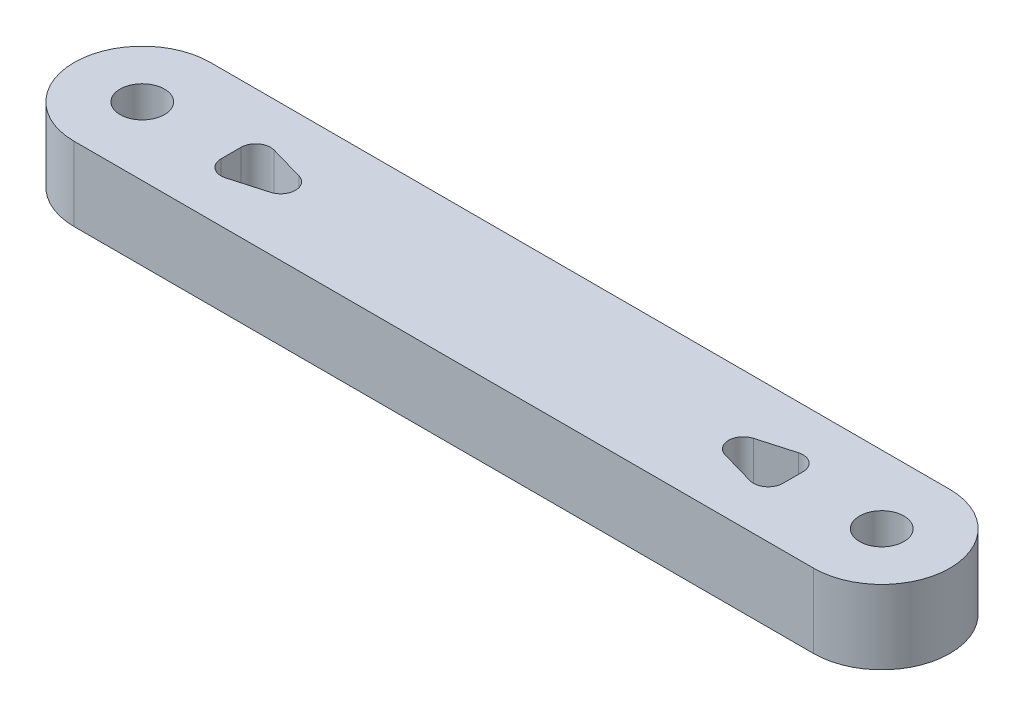
ISO-10303-21;
HEADER;
FILE_DESCRIPTION(('STEP AP214'),'2;1');
FILE_NAME('part.step','',(''),(''),'','','');
FILE_SCHEMA(('AUTOMOTIVE_DESIGN { 1 0 10303 214 1 1 1 1 }'));
ENDSEC;
DATA;
#1=APPLICATION_CONTEXT('core data for automotive mechanical design processes');
#2=APPLICATION_PROTOCOL_DEFINITION('international standard','automotive_design',2000,#1);
#3=PRODUCT_CONTEXT('',#1,'mechanical');
#4=PRODUCT('Part','Part','',(#3));
#5=PRODUCT_RELATED_PRODUCT_CATEGORY('part','',(#4));
#6=PRODUCT_DEFINITION_FORMATION('','',#4);
#7=PRODUCT_DEFINITION_CONTEXT('part definition',#1,'design');
#8=PRODUCT_DEFINITION('design','',#6,#7);
#9=PRODUCT_DEFINITION_SHAPE('','',#8);
#10=(LENGTH_UNIT() NAMED_UNIT(*) SI_UNIT(.MILLI.,.METRE.));
#11=(NAMED_UNIT(*) PLANE_ANGLE_UNIT() SI_UNIT($,.RADIAN.));
#12=(NAMED_UNIT(*) SI_UNIT($,.STERADIAN.) SOLID_ANGLE_UNIT());
#13=UNCERTAINTY_MEASURE_WITH_UNIT(LENGTH_MEASURE(1.E-05),#10,'distance_accuracy_value','');
#14=(GEOMETRIC_REPRESENTATION_CONTEXT(3) GLOBAL_UNCERTAINTY_ASSIGNED_CONTEXT((#13)) GLOBAL_UNIT_ASSIGNED_CONTEXT((#10,
#11,#12)) REPRESENTATION_CONTEXT('',''));
#15=CARTESIAN_POINT('',(0.,0.,0.));
#16=DIRECTION('',(0.,0.,1.));
#17=DIRECTION('',(1.,0.,0.));
#18=AXIS2_PLACEMENT_3D('',#15,#16,#17);
#19=CARTESIAN_POINT('',(50.,5.,0.));
#20=DIRECTION('',(0.,-1.,0.));
#21=DIRECTION('',(0.,0.,-1.));
#22=AXIS2_PLACEMENT_3D('',#19,#20,#21);
#23=CYLINDRICAL_SURFACE('',#22,1.5);
#24=CARTESIAN_POINT('',(50.,5.,0.));
#25=DIRECTION('',(0.,1.,0.));
#26=DIRECTION('',(0.,0.,1.));
#27=AXIS2_PLACEMENT_3D('',#24,#25,#26);
#28=CIRCLE('',#27,1.5);
#29=CARTESIAN_POINT('',(50.,5.,1.5));
#30=VERTEX_POINT('',#29);
#31=EDGE_CURVE('E266',#30,#30,#28,.T.);
#32=ORIENTED_EDGE('',*,*,#31,.T.);
#33=EDGE_LOOP('',(#32));
#34=FACE_BOUND('',#33,.T.);
#35=CARTESIAN_POINT('',(50.,0.,0.));
#36=DIRECTION('',(0.,1.,0.));
#37=DIRECTION('',(0.,0.,1.));
#38=AXIS2_PLACEMENT_3D('',#35,#36,#37);
#39=CIRCLE('',#38,1.5);
#40=CARTESIAN_POINT('',(50.,0.,1.5));
#41=VERTEX_POINT('',#40);
#42=EDGE_CURVE('E402',#41,#41,#39,.T.);
#43=ORIENTED_EDGE('',*,*,#42,.F.);
#44=EDGE_LOOP('',(#43));
#45=FACE_BOUND('',#44,.T.);
#46=ADVANCED_FACE('F129',(#34,#45),#23,.F.);
#47=CARTESIAN_POINT('',(0.,0.,0.));
#48=DIRECTION('',(0.,1.,0.));
#49=DIRECTION('',(0.,0.,1.));
#50=AXIS2_PLACEMENT_3D('',#47,#48,#49);
#51=PLANE('',#50);
#52=DIRECTION('',(0.,0.,1.));
#53=VECTOR('',#52,1.);
#54=CARTESIAN_POINT('',(6.,0.,0.));
#55=LINE('',#54,#53);
#56=CARTESIAN_POINT('',(6.,0.,-0.674270015817069));
#57=VERTEX_POINT('',#56);
#58=CARTESIAN_POINT('',(6.,0.,0.674270015817069));
#59=VERTEX_POINT('',#58);
#60=EDGE_CURVE('E367',#57,#59,#55,.T.);
#61=ORIENTED_EDGE('',*,*,#60,.T.);
#62=CARTESIAN_POINT('',(7.,0.,0.674270015817069));
#63=DIRECTION('',(0.,1.,0.));
#64=DIRECTION('',(0.,0.,1.));
#65=AXIS2_PLACEMENT_3D('',#62,#63,#64);
#66=CIRCLE('',#65,1.);
#67=CARTESIAN_POINT('',(7.27472112789738,0.,1.63579396345789));
#68=VERTEX_POINT('',#67);
#69=EDGE_CURVE('E346',#59,#68,#66,.T.);
#70=ORIENTED_EDGE('',*,*,#69,.T.);
#71=DIRECTION('',(0.961523947640823,0.,-0.274721127897378));
#72=VECTOR('',#71,1.);
#73=CARTESIAN_POINT('',(0.981132075471698,0.,3.43396226415094));
#74=LINE('',#73,#72);
#75=CARTESIAN_POINT('',(9.63466618325712,0.,0.961523947640821));
#76=VERTEX_POINT('',#75);
#77=EDGE_CURVE('E370',#68,#76,#74,.T.);
#78=ORIENTED_EDGE('',*,*,#77,.T.);
#79=CARTESIAN_POINT('',(9.35994505535974,0.,0.));
#80=DIRECTION('',(0.,1.,0.));
#81=DIRECTION('',(0.,0.,1.));
#82=AXIS2_PLACEMENT_3D('',#79,#80,#81);
#83=CIRCLE('',#82,1.);
#84=CARTESIAN_POINT('',(9.63466618325712,0.,-0.961523947640821));
#85=VERTEX_POINT('',#84);
#86=EDGE_CURVE('E340',#76,#85,#83,.T.);
#87=ORIENTED_EDGE('',*,*,#86,.T.);
#88=DIRECTION('',(-0.961523947640823,0.,-0.274721127897378));
#89=VECTOR('',#88,1.);
#90=CARTESIAN_POINT('',(0.981132075471698,0.,-3.43396226415094));
#91=LINE('',#90,#89);
#92=CARTESIAN_POINT('',(7.27472112789738,0.,-1.63579396345789));
#93=VERTEX_POINT('',#92);
#94=EDGE_CURVE('E376',#85,#93,#91,.T.);
#95=ORIENTED_EDGE('',*,*,#94,.T.);
#96=CARTESIAN_POINT('',(7.,0.,-0.674270015817069));
#97=DIRECTION('',(0.,1.,0.));
#98=DIRECTION('',(0.,0.,1.));
#99=AXIS2_PLACEMENT_3D('',#96,#97,#98);
#100=CIRCLE('',#99,1.);
#101=EDGE_CURVE('E12',#93,#57,#100,.T.);
#102=ORIENTED_EDGE('',*,*,#101,.T.);
#103=EDGE_LOOP('',(#61,#70,#78,#87,#95,#102));
#104=FACE_BOUND('',#103,.T.);
#105=DIRECTION('',(0.961523947640823,0.,0.274721127897379));
#106=VECTOR('',#105,1.);
#107=CARTESIAN_POINT('',(2.7924528301887,0.,-9.77358490566042));
#108=LINE('',#107,#106);
#109=CARTESIAN_POINT('',(40.3653338167429,0.,0.961523947640821));
#110=VERTEX_POINT('',#109);
#111=CARTESIAN_POINT('',(42.7252788721026,0.,1.6357939634579));
#112=VERTEX_POINT('',#111);
#113=EDGE_CURVE('E489',#110,#112,#108,.T.);
#114=ORIENTED_EDGE('',*,*,#113,.T.);
#115=CARTESIAN_POINT('',(43.,0.,0.674270015817072));
#116=DIRECTION('',(0.,1.,0.));
#117=DIRECTION('',(0.,0.,1.));
#118=AXIS2_PLACEMENT_3D('',#115,#116,#117);
#119=CIRCLE('',#118,1.);
#120=CARTESIAN_POINT('',(44.,0.,0.674270015817072));
#121=VERTEX_POINT('',#120);
#122=EDGE_CURVE('E322',#112,#121,#119,.T.);
#123=ORIENTED_EDGE('',*,*,#122,.T.);
#124=DIRECTION('',(0.,0.,-1.));
#125=VECTOR('',#124,1.);
#126=CARTESIAN_POINT('',(44.,0.,0.));
#127=LINE('',#126,#125);
#128=CARTESIAN_POINT('',(44.,0.,-0.674270015817073));
#129=VERTEX_POINT('',#128);
#130=EDGE_CURVE('E379',#121,#129,#127,.T.);
#131=ORIENTED_EDGE('',*,*,#130,.T.);
#132=CARTESIAN_POINT('',(43.,0.,-0.674270015817073));
#133=DIRECTION('',(0.,1.,0.));
#134=DIRECTION('',(0.,0.,1.));
#135=AXIS2_PLACEMENT_3D('',#132,#133,#134);
#136=CIRCLE('',#135,1.);
#137=CARTESIAN_POINT('',(42.7252788721026,0.,-1.6357939634579));
#138=VERTEX_POINT('',#137);
#139=EDGE_CURVE('E328',#129,#138,#136,.T.);
#140=ORIENTED_EDGE('',*,*,#139,.T.);
#141=DIRECTION('',(-0.961523947640823,0.,0.274721127897378));
#142=VECTOR('',#141,1.);
#143=CARTESIAN_POINT('',(2.79245283018868,0.,9.77358490566038));
#144=LINE('',#143,#142);
#145=CARTESIAN_POINT('',(40.3653338167429,0.,-0.961523947640829));
#146=VERTEX_POINT('',#145);
#147=EDGE_CURVE('E371',#138,#146,#144,.T.);
#148=ORIENTED_EDGE('',*,*,#147,.T.);
#149=CARTESIAN_POINT('',(40.6400549446403,0.,0.));
#150=DIRECTION('',(0.,1.,0.));
#151=DIRECTION('',(0.,0.,1.));
#152=AXIS2_PLACEMENT_3D('',#149,#150,#151);
#153=CIRCLE('',#152,1.);
#154=EDGE_CURVE('E334',#146,#110,#153,.T.);
#155=ORIENTED_EDGE('',*,*,#154,.T.);
#156=EDGE_LOOP('',(#114,#123,#131,#140,#148,#155));
#157=FACE_BOUND('',#156,.T.);
#158=CARTESIAN_POINT('',(0.,0.,0.));
#159=DIRECTION('',(0.,1.,0.));
#160=DIRECTION('',(0.,0.,1.));
#161=AXIS2_PLACEMENT_3D('',#158,#159,#160);
#162=CIRCLE('',#161,1.5);
#163=CARTESIAN_POINT('',(0.,0.,1.5));
#164=VERTEX_POINT('',#163);
#165=EDGE_CURVE('E385',#164,#164,#162,.T.);
#166=ORIENTED_EDGE('',*,*,#165,.T.);
#167=EDGE_LOOP('',(#166));
#168=FACE_BOUND('',#167,.T.);
#169=ORIENTED_EDGE('',*,*,#42,.T.);
#170=EDGE_LOOP('',(#169));
#171=FACE_BOUND('',#170,.T.);
#172=DIRECTION('',(1.,0.,0.));
#173=VECTOR('',#172,1.);
#174=CARTESIAN_POINT('',(0.,0.,4.61059088650664));
#175=LINE('',#174,#173);
#176=CARTESIAN_POINT('',(0.,0.,4.61059088650664));
#177=VERTEX_POINT('',#176);
#178=CARTESIAN_POINT('',(50.,0.,4.61059088650664));
#179=VERTEX_POINT('',#178);
#180=EDGE_CURVE('E270',#177,#179,#175,.T.);
#181=ORIENTED_EDGE('',*,*,#180,.F.);
#182=CARTESIAN_POINT('',(0.,0.,0.));
#183=DIRECTION('',(0.,1.,0.));
#184=DIRECTION('',(0.,0.,1.));
#185=AXIS2_PLACEMENT_3D('',#182,#183,#184);
#186=CIRCLE('',#185,4.61059088650664);
#187=CARTESIAN_POINT('',(0.,0.,-4.61059088650664));
#188=VERTEX_POINT('',#187);
#189=EDGE_CURVE('E390',#188,#177,#186,.T.);
#190=ORIENTED_EDGE('',*,*,#189,.F.);
#191=DIRECTION('',(1.,0.,0.));
#192=VECTOR('',#191,1.);
#193=CARTESIAN_POINT('',(0.,0.,-4.61059088650664));
#194=LINE('',#193,#192);
#195=CARTESIAN_POINT('',(50.,0.,-4.61059088650664));
#196=VERTEX_POINT('',#195);
#197=EDGE_CURVE('E411',#188,#196,#194,.T.);
#198=ORIENTED_EDGE('',*,*,#197,.T.);
#199=CARTESIAN_POINT('',(50.,0.,0.));
#200=DIRECTION('',(0.,1.,0.));
#201=DIRECTION('',(0.,0.,1.));
#202=AXIS2_PLACEMENT_3D('',#199,#200,#201);
#203=CIRCLE('',#202,4.61059088650664);
#204=EDGE_CURVE('E408',#179,#196,#203,.T.);
#205=ORIENTED_EDGE('',*,*,#204,.F.);
#206=EDGE_LOOP('',(#181,#190,#198,#205));
#207=FACE_BOUND('',#206,.T.);
#208=ADVANCED_FACE('F425',(#104,#157,#168,#171,#207),#51,.F.);
#209=CARTESIAN_POINT('',(0.,5.,0.));
#210=DIRECTION('',(0.,-1.,0.));
#211=DIRECTION('',(0.,0.,-1.));
#212=AXIS2_PLACEMENT_3D('',#209,#210,#211);
#213=CYLINDRICAL_SURFACE('',#212,1.5);
#214=CARTESIAN_POINT('',(0.,5.,0.));
#215=DIRECTION('',(0.,1.,0.));
#216=DIRECTION('',(0.,0.,1.));
#217=AXIS2_PLACEMENT_3D('',#214,#215,#216);
#218=CIRCLE('',#217,1.5);
#219=CARTESIAN_POINT('',(0.,5.,1.5));
#220=VERTEX_POINT('',#219);
#221=EDGE_CURVE('E386',#220,#220,#218,.T.);
#222=ORIENTED_EDGE('',*,*,#221,.T.);
#223=EDGE_LOOP('',(#222));
#224=FACE_BOUND('',#223,.T.);
#225=ORIENTED_EDGE('',*,*,#165,.F.);
#226=EDGE_LOOP('',(#225));
#227=FACE_BOUND('',#226,.T.);
#228=ADVANCED_FACE('F428',(#224,#227),#213,.F.);
#229=CARTESIAN_POINT('',(0.,5.,-4.61059088650664));
#230=DIRECTION('',(0.,0.,-1.));
#231=DIRECTION('',(-1.,0.,0.));
#232=AXIS2_PLACEMENT_3D('',#229,#230,#231);
#233=PLANE('',#232);
#234=ORIENTED_EDGE('',*,*,#197,.F.);
#235=DIRECTION('',(0.,-1.,0.));
#236=VECTOR('',#235,1.);
#237=CARTESIAN_POINT('',(0.,5.,-4.61059088650664));
#238=LINE('',#237,#236);
#239=CARTESIAN_POINT('',(0.,5.,-4.61059088650664));
#240=VERTEX_POINT('',#239);
#241=EDGE_CURVE('E278',#240,#188,#238,.T.);
#242=ORIENTED_EDGE('',*,*,#241,.F.);
#243=DIRECTION('',(1.,0.,0.));
#244=VECTOR('',#243,1.);
#245=CARTESIAN_POINT('',(0.,5.,-4.61059088650664));
#246=LINE('',#245,#244);
#247=CARTESIAN_POINT('',(50.,5.,-4.61059088650664));
#248=VERTEX_POINT('',#247);
#249=EDGE_CURVE('E255',#240,#248,#246,.T.);
#250=ORIENTED_EDGE('',*,*,#249,.T.);
#251=DIRECTION('',(0.,-1.,0.));
#252=VECTOR('',#251,1.);
#253=CARTESIAN_POINT('',(50.,5.,-4.61059088650664));
#254=LINE('',#253,#252);
#255=EDGE_CURVE('E250',#248,#196,#254,.T.);
#256=ORIENTED_EDGE('',*,*,#255,.T.);
#257=EDGE_LOOP('',(#234,#242,#250,#256));
#258=FACE_BOUND('',#257,.T.);
#259=ADVANCED_FACE('F426',(#258),#233,.T.);
#260=CARTESIAN_POINT('',(50.,5.,0.));
#261=DIRECTION('',(0.,-1.,0.));
#262=DIRECTION('',(0.,0.,-1.));
#263=AXIS2_PLACEMENT_3D('',#260,#261,#262);
#264=CYLINDRICAL_SURFACE('',#263,4.61059088650664);
#265=ORIENTED_EDGE('',*,*,#204,.T.);
#266=ORIENTED_EDGE('',*,*,#255,.F.);
#267=CARTESIAN_POINT('',(50.,5.,0.));
#268=DIRECTION('',(0.,1.,0.));
#269=DIRECTION('',(0.,0.,1.));
#270=AXIS2_PLACEMENT_3D('',#267,#268,#269);
#271=CIRCLE('',#270,4.61059088650664);
#272=CARTESIAN_POINT('',(50.,5.,4.61059088650664));
#273=VERTEX_POINT('',#272);
#274=EDGE_CURVE('E243',#273,#248,#271,.T.);
#275=ORIENTED_EDGE('',*,*,#274,.F.);
#276=DIRECTION('',(0.,-1.,0.));
#277=VECTOR('',#276,1.);
#278=CARTESIAN_POINT('',(50.,5.,4.61059088650664));
#279=LINE('',#278,#277);
#280=EDGE_CURVE('E248',#273,#179,#279,.T.);
#281=ORIENTED_EDGE('',*,*,#280,.T.);
#282=EDGE_LOOP('',(#265,#266,#275,#281));
#283=FACE_BOUND('',#282,.T.);
#284=ADVANCED_FACE('F246',(#283),#264,.T.);
#285=CARTESIAN_POINT('',(0.,5.,4.61059088650664));
#286=DIRECTION('',(0.,0.,-1.));
#287=DIRECTION('',(-1.,0.,0.));
#288=AXIS2_PLACEMENT_3D('',#285,#286,#287);
#289=PLANE('',#288);
#290=ORIENTED_EDGE('',*,*,#180,.T.);
#291=ORIENTED_EDGE('',*,*,#280,.F.);
#292=DIRECTION('',(1.,0.,0.));
#293=VECTOR('',#292,1.);
#294=CARTESIAN_POINT('',(0.,5.,4.61059088650664));
#295=LINE('',#294,#293);
#296=CARTESIAN_POINT('',(0.,5.,4.61059088650664));
#297=VERTEX_POINT('',#296);
#298=EDGE_CURVE('E256',#297,#273,#295,.T.);
#299=ORIENTED_EDGE('',*,*,#298,.F.);
#300=DIRECTION('',(0.,-1.,0.));
#301=VECTOR('',#300,1.);
#302=CARTESIAN_POINT('',(0.,5.,4.61059088650664));
#303=LINE('',#302,#301);
#304=EDGE_CURVE('E398',#297,#177,#303,.T.);
#305=ORIENTED_EDGE('',*,*,#304,.T.);
#306=EDGE_LOOP('',(#290,#291,#299,#305));
#307=FACE_BOUND('',#306,.T.);
#308=ADVANCED_FACE('F268',(#307),#289,.F.);
#309=CARTESIAN_POINT('',(0.,5.,0.));
#310=DIRECTION('',(0.,-1.,0.));
#311=DIRECTION('',(0.,0.,-1.));
#312=AXIS2_PLACEMENT_3D('',#309,#310,#311);
#313=CYLINDRICAL_SURFACE('',#312,4.61059088650664);
#314=ORIENTED_EDGE('',*,*,#189,.T.);
#315=ORIENTED_EDGE('',*,*,#304,.F.);
#316=CARTESIAN_POINT('',(0.,5.,0.));
#317=DIRECTION('',(0.,1.,0.));
#318=DIRECTION('',(0.,0.,1.));
#319=AXIS2_PLACEMENT_3D('',#316,#317,#318);
#320=CIRCLE('',#319,4.61059088650664);
#321=EDGE_CURVE('E261',#240,#297,#320,.T.);
#322=ORIENTED_EDGE('',*,*,#321,.F.);
#323=ORIENTED_EDGE('',*,*,#241,.T.);
#324=EDGE_LOOP('',(#314,#315,#322,#323));
#325=FACE_BOUND('',#324,.T.);
#326=ADVANCED_FACE('F421',(#325),#313,.T.);
#327=CARTESIAN_POINT('',(0.,5.,0.));
#328=DIRECTION('',(0.,1.,0.));
#329=DIRECTION('',(0.,0.,1.));
#330=AXIS2_PLACEMENT_3D('',#327,#328,#329);
#331=PLANE('',#330);
#332=DIRECTION('',(-0.961523947640823,0.,-0.274721127897378));
#333=VECTOR('',#332,1.);
#334=CARTESIAN_POINT('',(6.,5.,-2.));
#335=LINE('',#334,#333);
#336=CARTESIAN_POINT('',(9.63466618325712,5.,-0.961523947640822));
#337=VERTEX_POINT('',#336);
#338=CARTESIAN_POINT('',(7.27472112789738,5.,-1.63579396345789));
#339=VERTEX_POINT('',#338);
#340=EDGE_CURVE('E354',#337,#339,#335,.T.);
#341=ORIENTED_EDGE('',*,*,#340,.F.);
#342=CARTESIAN_POINT('',(9.35994505535974,5.,0.));
#343=DIRECTION('',(0.,1.,0.));
#344=DIRECTION('',(0.,0.,1.));
#345=AXIS2_PLACEMENT_3D('',#342,#343,#344);
#346=CIRCLE('',#345,1.);
#347=CARTESIAN_POINT('',(9.63466618325712,5.,0.961523947640822));
#348=VERTEX_POINT('',#347);
#349=EDGE_CURVE('E337',#337,#348,#346,.F.);
#350=ORIENTED_EDGE('',*,*,#349,.T.);
#351=DIRECTION('',(0.961523947640823,0.,-0.274721127897378));
#352=VECTOR('',#351,1.);
#353=CARTESIAN_POINT('',(6.,5.,2.));
#354=LINE('',#353,#352);
#355=CARTESIAN_POINT('',(7.27472112789738,5.,1.63579396345789));
#356=VERTEX_POINT('',#355);
#357=EDGE_CURVE('E487',#356,#348,#354,.T.);
#358=ORIENTED_EDGE('',*,*,#357,.F.);
#359=CARTESIAN_POINT('',(7.,5.,0.674270015817069));
#360=DIRECTION('',(0.,1.,0.));
#361=DIRECTION('',(0.,0.,1.));
#362=AXIS2_PLACEMENT_3D('',#359,#360,#361);
#363=CIRCLE('',#362,1.);
#364=CARTESIAN_POINT('',(6.,5.,0.674270015817069));
#365=VERTEX_POINT('',#364);
#366=EDGE_CURVE('E343',#356,#365,#363,.F.);
#367=ORIENTED_EDGE('',*,*,#366,.T.);
#368=DIRECTION('',(0.,0.,1.));
#369=VECTOR('',#368,1.);
#370=CARTESIAN_POINT('',(6.,5.,-2.));
#371=LINE('',#370,#369);
#372=CARTESIAN_POINT('',(6.,5.,-0.674270015817069));
#373=VERTEX_POINT('',#372);
#374=EDGE_CURVE('E355',#373,#365,#371,.T.);
#375=ORIENTED_EDGE('',*,*,#374,.F.);
#376=CARTESIAN_POINT('',(7.,5.,-0.674270015817069));
#377=DIRECTION('',(0.,1.,0.));
#378=DIRECTION('',(0.,0.,1.));
#379=AXIS2_PLACEMENT_3D('',#376,#377,#378);
#380=CIRCLE('',#379,1.);
#381=EDGE_CURVE('E138',#373,#339,#380,.F.);
#382=ORIENTED_EDGE('',*,*,#381,.T.);
#383=EDGE_LOOP('',(#341,#350,#358,#367,#375,#382));
#384=FACE_BOUND('',#383,.T.);
#385=DIRECTION('',(-0.961523947640823,0.,0.274721127897378));
#386=VECTOR('',#385,1.);
#387=CARTESIAN_POINT('',(44.,5.,-2.));
#388=LINE('',#387,#386);
#389=CARTESIAN_POINT('',(42.7252788721026,5.,-1.6357939634579));
#390=VERTEX_POINT('',#389);
#391=CARTESIAN_POINT('',(40.3653338167429,5.,-0.961523947640825));
#392=VERTEX_POINT('',#391);
#393=EDGE_CURVE('E364',#390,#392,#388,.T.);
#394=ORIENTED_EDGE('',*,*,#393,.F.);
#395=CARTESIAN_POINT('',(43.,5.,-0.674270015817073));
#396=DIRECTION('',(0.,1.,0.));
#397=DIRECTION('',(0.,0.,1.));
#398=AXIS2_PLACEMENT_3D('',#395,#396,#397);
#399=CIRCLE('',#398,1.);
#400=CARTESIAN_POINT('',(44.,5.,-0.674270015817073));
#401=VERTEX_POINT('',#400);
#402=EDGE_CURVE('E325',#390,#401,#399,.F.);
#403=ORIENTED_EDGE('',*,*,#402,.T.);
#404=DIRECTION('',(0.,0.,-1.));
#405=VECTOR('',#404,1.);
#406=CARTESIAN_POINT('',(44.,5.,-2.));
#407=LINE('',#406,#405);
#408=CARTESIAN_POINT('',(44.,5.,0.674270015817072));
#409=VERTEX_POINT('',#408);
#410=EDGE_CURVE('E497',#409,#401,#407,.T.);
#411=ORIENTED_EDGE('',*,*,#410,.F.);
#412=CARTESIAN_POINT('',(43.,5.,0.674270015817072));
#413=DIRECTION('',(0.,1.,0.));
#414=DIRECTION('',(0.,0.,1.));
#415=AXIS2_PLACEMENT_3D('',#412,#413,#414);
#416=CIRCLE('',#415,1.);
#417=CARTESIAN_POINT('',(42.7252788721026,5.,1.6357939634579));
#418=VERTEX_POINT('',#417);
#419=EDGE_CURVE('E319',#409,#418,#416,.F.);
#420=ORIENTED_EDGE('',*,*,#419,.T.);
#421=DIRECTION('',(0.961523947640823,0.,0.274721127897379));
#422=VECTOR('',#421,1.);
#423=CARTESIAN_POINT('',(44.,5.,2.));
#424=LINE('',#423,#422);
#425=CARTESIAN_POINT('',(40.3653338167429,5.,0.961523947640822));
#426=VERTEX_POINT('',#425);
#427=EDGE_CURVE('E501',#426,#418,#424,.T.);
#428=ORIENTED_EDGE('',*,*,#427,.F.);
#429=CARTESIAN_POINT('',(40.6400549446403,5.,0.));
#430=DIRECTION('',(0.,1.,0.));
#431=DIRECTION('',(0.,0.,1.));
#432=AXIS2_PLACEMENT_3D('',#429,#430,#431);
#433=CIRCLE('',#432,1.);
#434=EDGE_CURVE('E331',#426,#392,#433,.F.);
#435=ORIENTED_EDGE('',*,*,#434,.T.);
#436=EDGE_LOOP('',(#394,#403,#411,#420,#428,#435));
#437=FACE_BOUND('',#436,.T.);
#438=ORIENTED_EDGE('',*,*,#221,.F.);
#439=EDGE_LOOP('',(#438));
#440=FACE_BOUND('',#439,.T.);
#441=ORIENTED_EDGE('',*,*,#31,.F.);
#442=EDGE_LOOP('',(#441));
#443=FACE_BOUND('',#442,.T.);
#444=ORIENTED_EDGE('',*,*,#298,.T.);
#445=ORIENTED_EDGE('',*,*,#274,.T.);
#446=ORIENTED_EDGE('',*,*,#249,.F.);
#447=ORIENTED_EDGE('',*,*,#321,.T.);
#448=EDGE_LOOP('',(#444,#445,#446,#447));
#449=FACE_BOUND('',#448,.T.);
#450=ADVANCED_FACE('F259',(#384,#437,#440,#443,#449),#331,.T.);
#451=CARTESIAN_POINT('',(44.,-12.,-2.));
#452=DIRECTION('',(-0.274721127897378,0.,-0.961523947640823));
#453=DIRECTION('',(-0.961523947640823,0.,0.274721127897378));
#454=AXIS2_PLACEMENT_3D('',#451,#452,#453);
#455=PLANE('',#454);
#456=ORIENTED_EDGE('',*,*,#147,.F.);
#457=DIRECTION('',(0.,1.,0.));
#458=VECTOR('',#457,1.);
#459=CARTESIAN_POINT('',(42.7252788721026,4.99999999999999,-1.6357939634579));
#460=LINE('',#459,#458);
#461=EDGE_CURVE('E295',#138,#390,#460,.T.);
#462=ORIENTED_EDGE('',*,*,#461,.T.);
#463=ORIENTED_EDGE('',*,*,#393,.T.);
#464=DIRECTION('',(0.,1.,0.));
#465=VECTOR('',#464,1.);
#466=CARTESIAN_POINT('',(40.3653338167429,0.,-0.961523947640825));
#467=LINE('',#466,#465);
#468=EDGE_CURVE('E292',#392,#146,#467,.F.);
#469=ORIENTED_EDGE('',*,*,#468,.T.);
#470=EDGE_LOOP('',(#456,#462,#463,#469));
#471=FACE_BOUND('',#470,.T.);
#472=ADVANCED_FACE('F453',(#471),#455,.F.);
#473=CARTESIAN_POINT('',(44.,-12.,-2.));
#474=DIRECTION('',(1.,0.,0.));
#475=DIRECTION('',(0.,0.,-1.));
#476=AXIS2_PLACEMENT_3D('',#473,#474,#475);
#477=PLANE('',#476);
#478=ORIENTED_EDGE('',*,*,#130,.F.);
#479=DIRECTION('',(0.,1.,0.));
#480=VECTOR('',#479,1.);
#481=CARTESIAN_POINT('',(44.,5.,0.674270015817072));
#482=LINE('',#481,#480);
#483=EDGE_CURVE('E276',#121,#409,#482,.T.);
#484=ORIENTED_EDGE('',*,*,#483,.T.);
#485=ORIENTED_EDGE('',*,*,#410,.T.);
#486=DIRECTION('',(0.,1.,0.));
#487=VECTOR('',#486,1.);
#488=CARTESIAN_POINT('',(44.,0.,-0.674270015817073));
#489=LINE('',#488,#487);
#490=EDGE_CURVE('E272',#401,#129,#489,.F.);
#491=ORIENTED_EDGE('',*,*,#490,.T.);
#492=EDGE_LOOP('',(#478,#484,#485,#491));
#493=FACE_BOUND('',#492,.T.);
#494=ADVANCED_FACE('F530',(#493),#477,.F.);
#495=CARTESIAN_POINT('',(44.,-12.,2.));
#496=DIRECTION('',(-0.274721127897379,0.,0.961523947640823));
#497=DIRECTION('',(0.961523947640823,0.,0.274721127897379));
#498=AXIS2_PLACEMENT_3D('',#495,#496,#497);
#499=PLANE('',#498);
#500=ORIENTED_EDGE('',*,*,#427,.T.);
#501=DIRECTION('',(0.,1.,0.));
#502=VECTOR('',#501,1.);
#503=CARTESIAN_POINT('',(42.7252788721026,0.,1.63579396345789));
#504=LINE('',#503,#502);
#505=EDGE_CURVE('E289',#418,#112,#504,.F.);
#506=ORIENTED_EDGE('',*,*,#505,.T.);
#507=ORIENTED_EDGE('',*,*,#113,.F.);
#508=DIRECTION('',(0.,1.,0.));
#509=VECTOR('',#508,1.);
#510=CARTESIAN_POINT('',(40.3653338167429,5.,0.961523947640821));
#511=LINE('',#510,#509);
#512=EDGE_CURVE('E285',#110,#426,#511,.T.);
#513=ORIENTED_EDGE('',*,*,#512,.T.);
#514=EDGE_LOOP('',(#500,#506,#507,#513));
#515=FACE_BOUND('',#514,.T.);
#516=ADVANCED_FACE('F528',(#515),#499,.F.);
#517=CARTESIAN_POINT('',(6.,-12.,-2.));
#518=DIRECTION('',(0.274721127897378,0.,-0.961523947640823));
#519=DIRECTION('',(-0.961523947640823,0.,-0.274721127897378));
#520=AXIS2_PLACEMENT_3D('',#517,#518,#519);
#521=PLANE('',#520);
#522=ORIENTED_EDGE('',*,*,#94,.F.);
#523=DIRECTION('',(0.,1.,0.));
#524=VECTOR('',#523,1.);
#525=CARTESIAN_POINT('',(9.63466618325712,5.,-0.961523947640823));
#526=LINE('',#525,#524);
#527=EDGE_CURVE('E302',#85,#337,#526,.T.);
#528=ORIENTED_EDGE('',*,*,#527,.T.);
#529=ORIENTED_EDGE('',*,*,#340,.T.);
#530=DIRECTION('',(0.,1.,0.));
#531=VECTOR('',#530,1.);
#532=CARTESIAN_POINT('',(7.27472112789738,0.,-1.63579396345789));
#533=LINE('',#532,#531);
#534=EDGE_CURVE('E299',#339,#93,#533,.F.);
#535=ORIENTED_EDGE('',*,*,#534,.T.);
#536=EDGE_LOOP('',(#522,#528,#529,#535));
#537=FACE_BOUND('',#536,.T.);
#538=ADVANCED_FACE('F361',(#537),#521,.F.);
#539=CARTESIAN_POINT('',(6.,-12.,2.));
#540=DIRECTION('',(0.274721127897378,0.,0.961523947640823));
#541=DIRECTION('',(0.961523947640823,0.,-0.274721127897378));
#542=AXIS2_PLACEMENT_3D('',#539,#540,#541);
#543=PLANE('',#542);
#544=ORIENTED_EDGE('',*,*,#357,.T.);
#545=DIRECTION('',(0.,1.,0.));
#546=VECTOR('',#545,1.);
#547=CARTESIAN_POINT('',(9.63466618325712,0.,0.961523947640823));
#548=LINE('',#547,#546);
#549=EDGE_CURVE('E310',#348,#76,#548,.F.);
#550=ORIENTED_EDGE('',*,*,#549,.T.);
#551=ORIENTED_EDGE('',*,*,#77,.F.);
#552=DIRECTION('',(0.,1.,0.));
#553=VECTOR('',#552,1.);
#554=CARTESIAN_POINT('',(7.27472112789738,4.99999999999999,1.63579396345789));
#555=LINE('',#554,#553);
#556=EDGE_CURVE('E306',#68,#356,#555,.T.);
#557=ORIENTED_EDGE('',*,*,#556,.T.);
#558=EDGE_LOOP('',(#544,#550,#551,#557));
#559=FACE_BOUND('',#558,.T.);
#560=ADVANCED_FACE('F484',(#559),#543,.F.);
#561=CARTESIAN_POINT('',(6.,-12.,-2.));
#562=DIRECTION('',(-1.,0.,0.));
#563=DIRECTION('',(0.,0.,1.));
#564=AXIS2_PLACEMENT_3D('',#561,#562,#563);
#565=PLANE('',#564);
#566=ORIENTED_EDGE('',*,*,#374,.T.);
#567=DIRECTION('',(0.,1.,0.));
#568=VECTOR('',#567,1.);
#569=CARTESIAN_POINT('',(6.,0.,0.674270015817069));
#570=LINE('',#569,#568);
#571=EDGE_CURVE('E145',#365,#59,#570,.F.);
#572=ORIENTED_EDGE('',*,*,#571,.T.);
#573=ORIENTED_EDGE('',*,*,#60,.F.);
#574=DIRECTION('',(0.,1.,0.));
#575=VECTOR('',#574,1.);
#576=CARTESIAN_POINT('',(6.,4.99999999999999,-0.674270015817069));
#577=LINE('',#576,#575);
#578=EDGE_CURVE('E313',#57,#373,#577,.T.);
#579=ORIENTED_EDGE('',*,*,#578,.T.);
#580=EDGE_LOOP('',(#566,#572,#573,#579));
#581=FACE_BOUND('',#580,.T.);
#582=ADVANCED_FACE('F366',(#581),#565,.F.);
#583=CARTESIAN_POINT('',(43.,-12.,0.674270015817072));
#584=DIRECTION('',(0.,-1.,0.));
#585=DIRECTION('',(0.,0.,-1.));
#586=AXIS2_PLACEMENT_3D('',#583,#584,#585);
#587=CYLINDRICAL_SURFACE('',#586,1.);
#588=ORIENTED_EDGE('',*,*,#122,.F.);
#589=ORIENTED_EDGE('',*,*,#505,.F.);
#590=ORIENTED_EDGE('',*,*,#419,.F.);
#591=ORIENTED_EDGE('',*,*,#483,.F.);
#592=EDGE_LOOP('',(#588,#589,#590,#591));
#593=FACE_BOUND('',#592,.T.);
#594=ADVANCED_FACE('F458',(#593),#587,.F.);
#595=CARTESIAN_POINT('',(43.,-12.,-0.674270015817073));
#596=DIRECTION('',(0.,-1.,0.));
#597=DIRECTION('',(0.,0.,-1.));
#598=AXIS2_PLACEMENT_3D('',#595,#596,#597);
#599=CYLINDRICAL_SURFACE('',#598,1.);
#600=ORIENTED_EDGE('',*,*,#139,.F.);
#601=ORIENTED_EDGE('',*,*,#490,.F.);
#602=ORIENTED_EDGE('',*,*,#402,.F.);
#603=ORIENTED_EDGE('',*,*,#461,.F.);
#604=EDGE_LOOP('',(#600,#601,#602,#603));
#605=FACE_BOUND('',#604,.T.);
#606=ADVANCED_FACE('F461',(#605),#599,.F.);
#607=CARTESIAN_POINT('',(40.6400549446403,-12.,0.));
#608=DIRECTION('',(0.,-1.,0.));
#609=DIRECTION('',(0.,0.,-1.));
#610=AXIS2_PLACEMENT_3D('',#607,#608,#609);
#611=CYLINDRICAL_SURFACE('',#610,1.);
#612=ORIENTED_EDGE('',*,*,#154,.F.);
#613=ORIENTED_EDGE('',*,*,#468,.F.);
#614=ORIENTED_EDGE('',*,*,#434,.F.);
#615=ORIENTED_EDGE('',*,*,#512,.F.);
#616=EDGE_LOOP('',(#612,#613,#614,#615));
#617=FACE_BOUND('',#616,.T.);
#618=ADVANCED_FACE('F465',(#617),#611,.F.);
#619=CARTESIAN_POINT('',(9.35994505535974,-12.,0.));
#620=DIRECTION('',(0.,-1.,0.));
#621=DIRECTION('',(0.,0.,-1.));
#622=AXIS2_PLACEMENT_3D('',#619,#620,#621);
#623=CYLINDRICAL_SURFACE('',#622,1.);
#624=ORIENTED_EDGE('',*,*,#86,.F.);
#625=ORIENTED_EDGE('',*,*,#549,.F.);
#626=ORIENTED_EDGE('',*,*,#349,.F.);
#627=ORIENTED_EDGE('',*,*,#527,.F.);
#628=EDGE_LOOP('',(#624,#625,#626,#627));
#629=FACE_BOUND('',#628,.T.);
#630=ADVANCED_FACE('F469',(#629),#623,.F.);
#631=CARTESIAN_POINT('',(7.,-12.,0.674270015817069));
#632=DIRECTION('',(0.,-1.,0.));
#633=DIRECTION('',(0.,0.,-1.));
#634=AXIS2_PLACEMENT_3D('',#631,#632,#633);
#635=CYLINDRICAL_SURFACE('',#634,1.);
#636=ORIENTED_EDGE('',*,*,#69,.F.);
#637=ORIENTED_EDGE('',*,*,#571,.F.);
#638=ORIENTED_EDGE('',*,*,#366,.F.);
#639=ORIENTED_EDGE('',*,*,#556,.F.);
#640=EDGE_LOOP('',(#636,#637,#638,#639));
#641=FACE_BOUND('',#640,.T.);
#642=ADVANCED_FACE('F472',(#641),#635,.F.);
#643=CARTESIAN_POINT('',(7.,-12.,-0.674270015817069));
#644=DIRECTION('',(0.,-1.,0.));
#645=DIRECTION('',(0.,0.,-1.));
#646=AXIS2_PLACEMENT_3D('',#643,#644,#645);
#647=CYLINDRICAL_SURFACE('',#646,1.);
#648=ORIENTED_EDGE('',*,*,#101,.F.);
#649=ORIENTED_EDGE('',*,*,#534,.F.);
#650=ORIENTED_EDGE('',*,*,#381,.F.);
#651=ORIENTED_EDGE('',*,*,#578,.F.);
#652=EDGE_LOOP('',(#648,#649,#650,#651));
#653=FACE_BOUND('',#652,.T.);
#654=ADVANCED_FACE('F131',(#653),#647,.F.);
#655=CLOSED_SHELL('',(#46,#208,#228,#259,#284,#308,#326,#450,#472,#494,#516,#538,#560,#582,#594,
#606,#618,#630,#642,#654));
#656=MANIFOLD_SOLID_BREP('B2',#655);
#657=ADVANCED_BREP_SHAPE_REPRESENTATION('',(#18,#656),#14);
#658=SHAPE_DEFINITION_REPRESENTATION(#9,#657);
ENDSEC;
END-ISO-10303-21;
